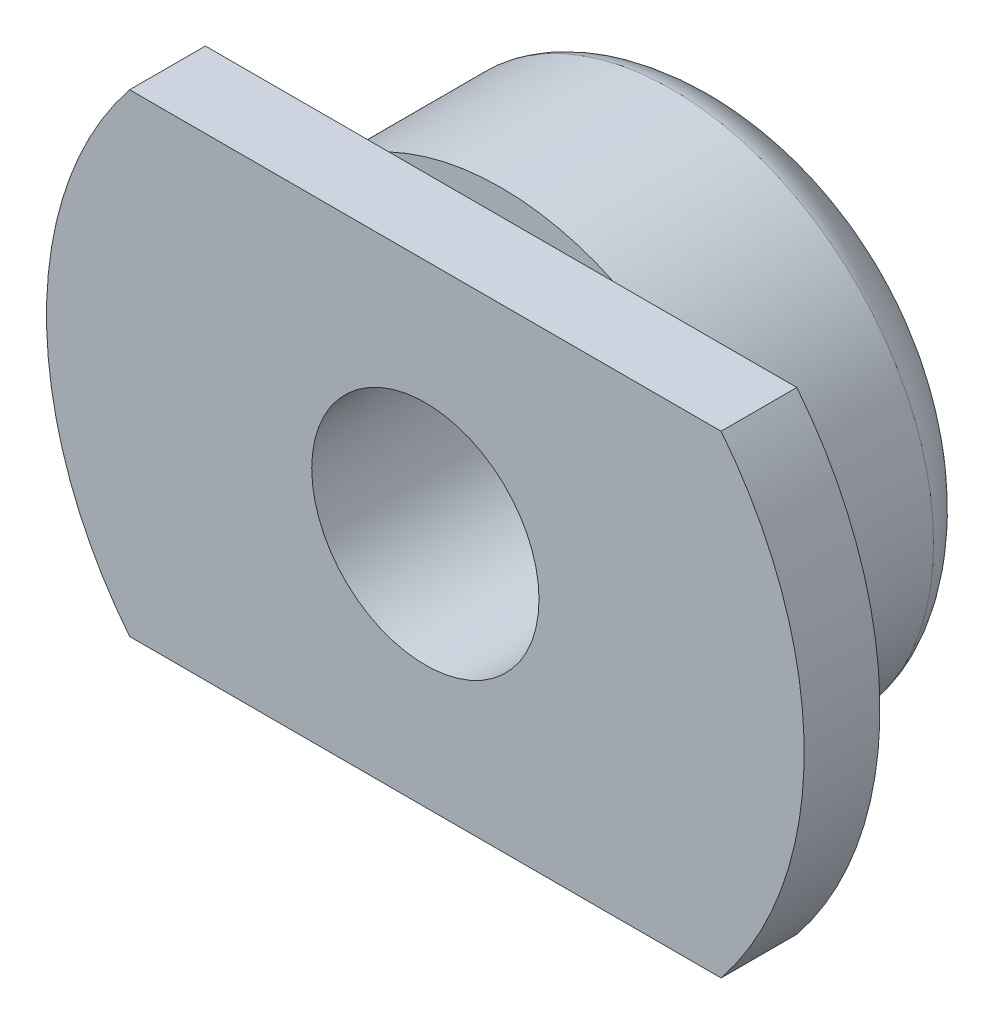
ISO-10303-21;
HEADER;
FILE_DESCRIPTION(('STEP AP214'),'2;1');
FILE_NAME('part.step','',(''),(''),'','','');
FILE_SCHEMA(('AUTOMOTIVE_DESIGN { 1 0 10303 214 1 1 1 1 }'));
ENDSEC;
DATA;
#1=APPLICATION_CONTEXT('core data for automotive mechanical design processes');
#2=APPLICATION_PROTOCOL_DEFINITION('international standard','automotive_design',2000,#1);
#3=PRODUCT_CONTEXT('',#1,'mechanical');
#4=PRODUCT('Part','Part','',(#3));
#5=PRODUCT_RELATED_PRODUCT_CATEGORY('part','',(#4));
#6=PRODUCT_DEFINITION_FORMATION('','',#4);
#7=PRODUCT_DEFINITION_CONTEXT('part definition',#1,'design');
#8=PRODUCT_DEFINITION('design','',#6,#7);
#9=PRODUCT_DEFINITION_SHAPE('','',#8);
#10=(LENGTH_UNIT() NAMED_UNIT(*) SI_UNIT(.MILLI.,.METRE.));
#11=(NAMED_UNIT(*) PLANE_ANGLE_UNIT() SI_UNIT($,.RADIAN.));
#12=(NAMED_UNIT(*) SI_UNIT($,.STERADIAN.) SOLID_ANGLE_UNIT());
#13=UNCERTAINTY_MEASURE_WITH_UNIT(LENGTH_MEASURE(1.E-05),#10,'distance_accuracy_value','');
#14=(GEOMETRIC_REPRESENTATION_CONTEXT(3) GLOBAL_UNCERTAINTY_ASSIGNED_CONTEXT((#13)) GLOBAL_UNIT_ASSIGNED_CONTEXT((#10,
#11,#12)) REPRESENTATION_CONTEXT('',''));
#15=CARTESIAN_POINT('',(0.,0.,0.));
#16=DIRECTION('',(0.,0.,1.));
#17=DIRECTION('',(1.,0.,0.));
#18=AXIS2_PLACEMENT_3D('',#15,#16,#17);
#19=CARTESIAN_POINT('',(0.,0.,5.4));
#20=DIRECTION('',(0.,0.,-1.));
#21=DIRECTION('',(-1.,0.,0.));
#22=AXIS2_PLACEMENT_3D('',#19,#20,#21);
#23=CYLINDRICAL_SURFACE('',#22,6.);
#24=DIRECTION('',(0.,0.,-1.));
#25=VECTOR('',#24,1.);
#26=CARTESIAN_POINT('',(4.6837484987988,3.75,5.4));
#27=LINE('',#26,#25);
#28=CARTESIAN_POINT('',(4.6837484987988,3.75,5.4));
#29=VERTEX_POINT('',#28);
#30=CARTESIAN_POINT('',(4.6837484987988,3.75,4.2));
#31=VERTEX_POINT('',#30);
#32=EDGE_CURVE('E123',#29,#31,#27,.T.);
#33=ORIENTED_EDGE('',*,*,#32,.F.);
#34=CARTESIAN_POINT('',(0.,0.,5.4));
#35=DIRECTION('',(0.,0.,1.));
#36=DIRECTION('',(1.,0.,0.));
#37=AXIS2_PLACEMENT_3D('',#34,#35,#36);
#38=CIRCLE('',#37,6.);
#39=CARTESIAN_POINT('',(4.6837484987988,-3.75,5.4));
#40=VERTEX_POINT('',#39);
#41=EDGE_CURVE('E116',#40,#29,#38,.T.);
#42=ORIENTED_EDGE('',*,*,#41,.F.);
#43=DIRECTION('',(0.,0.,-1.));
#44=VECTOR('',#43,1.);
#45=CARTESIAN_POINT('',(4.6837484987988,-3.75,5.4));
#46=LINE('',#45,#44);
#47=CARTESIAN_POINT('',(4.6837484987988,-3.75,4.2));
#48=VERTEX_POINT('',#47);
#49=EDGE_CURVE('E95',#48,#40,#46,.F.);
#50=ORIENTED_EDGE('',*,*,#49,.F.);
#51=CARTESIAN_POINT('',(0.,0.,4.2));
#52=DIRECTION('',(0.,0.,1.));
#53=DIRECTION('',(1.,0.,0.));
#54=AXIS2_PLACEMENT_3D('',#51,#52,#53);
#55=CIRCLE('',#54,6.);
#56=EDGE_CURVE('E125',#48,#31,#55,.T.);
#57=ORIENTED_EDGE('',*,*,#56,.T.);
#58=EDGE_LOOP('',(#33,#42,#50,#57));
#59=FACE_BOUND('',#58,.T.);
#60=ADVANCED_FACE('F39',(#59),#23,.T.);
#61=DIRECTION('',(0.,0.,-1.));
#62=VECTOR('',#61,1.);
#63=CARTESIAN_POINT('',(-4.6837484987988,3.75,5.4));
#64=LINE('',#63,#62);
#65=CARTESIAN_POINT('',(-4.6837484987988,3.75,4.2));
#66=VERTEX_POINT('',#65);
#67=CARTESIAN_POINT('',(-4.6837484987988,3.75,5.4));
#68=VERTEX_POINT('',#67);
#69=EDGE_CURVE('E111',#66,#68,#64,.F.);
#70=ORIENTED_EDGE('',*,*,#69,.F.);
#71=CARTESIAN_POINT('',(-4.6837484987988,-3.75,4.2));
#72=VERTEX_POINT('',#71);
#73=EDGE_CURVE('E110',#66,#72,#55,.T.);
#74=ORIENTED_EDGE('',*,*,#73,.T.);
#75=DIRECTION('',(0.,0.,-1.));
#76=VECTOR('',#75,1.);
#77=CARTESIAN_POINT('',(-4.6837484987988,-3.75,5.4));
#78=LINE('',#77,#76);
#79=CARTESIAN_POINT('',(-4.6837484987988,-3.75,5.4));
#80=VERTEX_POINT('',#79);
#81=EDGE_CURVE('E92',#80,#72,#78,.T.);
#82=ORIENTED_EDGE('',*,*,#81,.F.);
#83=EDGE_CURVE('E108',#68,#80,#38,.T.);
#84=ORIENTED_EDGE('',*,*,#83,.F.);
#85=EDGE_LOOP('',(#70,#74,#82,#84));
#86=FACE_BOUND('',#85,.T.);
#87=ADVANCED_FACE('F107',(#86),#23,.T.);
#88=CARTESIAN_POINT('',(0.,0.,5.4));
#89=DIRECTION('',(0.,0.,1.));
#90=DIRECTION('',(1.,0.,0.));
#91=AXIS2_PLACEMENT_3D('',#88,#89,#90);
#92=PLANE('',#91);
#93=CARTESIAN_POINT('',(0.000210646153013527,-7.86805516572731E-08,5.4));
#94=DIRECTION('',(0.,0.,1.));
#95=DIRECTION('',(1.,0.,0.));
#96=AXIS2_PLACEMENT_3D('',#93,#94,#95);
#97=CIRCLE('',#96,1.8);
#98=CARTESIAN_POINT('',(1.80021064615301,-7.86805516572731E-08,5.4));
#99=VERTEX_POINT('',#98);
#100=EDGE_CURVE('E162',#99,#99,#97,.T.);
#101=ORIENTED_EDGE('',*,*,#100,.F.);
#102=EDGE_LOOP('',(#101));
#103=FACE_BOUND('',#102,.T.);
#104=ORIENTED_EDGE('',*,*,#41,.T.);
#105=DIRECTION('',(-1.,0.,0.));
#106=VECTOR('',#105,1.);
#107=CARTESIAN_POINT('',(6.5,3.75,5.4));
#108=LINE('',#107,#106);
#109=EDGE_CURVE('E100',#29,#68,#108,.T.);
#110=ORIENTED_EDGE('',*,*,#109,.T.);
#111=ORIENTED_EDGE('',*,*,#83,.T.);
#112=DIRECTION('',(1.,0.,0.));
#113=VECTOR('',#112,1.);
#114=CARTESIAN_POINT('',(6.5,-3.75,5.4));
#115=LINE('',#114,#113);
#116=EDGE_CURVE('E89',#80,#40,#115,.T.);
#117=ORIENTED_EDGE('',*,*,#116,.T.);
#118=EDGE_LOOP('',(#104,#110,#111,#117));
#119=FACE_BOUND('',#118,.T.);
#120=ADVANCED_FACE('F114',(#103,#119),#92,.T.);
#121=CARTESIAN_POINT('',(0.,0.,4.2));
#122=DIRECTION('',(0.,0.,1.));
#123=DIRECTION('',(1.,0.,0.));
#124=AXIS2_PLACEMENT_3D('',#121,#122,#123);
#125=PLANE('',#124);
#126=DIRECTION('',(-1.,0.,0.));
#127=VECTOR('',#126,1.);
#128=CARTESIAN_POINT('',(0.,3.75,4.2));
#129=LINE('',#128,#127);
#130=CARTESIAN_POINT('',(1.77763888346312,3.75,4.2));
#131=VERTEX_POINT('',#130);
#132=EDGE_CURVE('E12',#31,#131,#129,.T.);
#133=ORIENTED_EDGE('',*,*,#132,.F.);
#134=ORIENTED_EDGE('',*,*,#56,.F.);
#135=DIRECTION('',(1.,0.,0.));
#136=VECTOR('',#135,1.);
#137=CARTESIAN_POINT('',(0.,-3.75,4.2));
#138=LINE('',#137,#136);
#139=CARTESIAN_POINT('',(1.77763888346312,-3.75,4.2));
#140=VERTEX_POINT('',#139);
#141=EDGE_CURVE('E279',#140,#48,#138,.T.);
#142=ORIENTED_EDGE('',*,*,#141,.F.);
#143=CARTESIAN_POINT('',(0.,0.,4.2));
#144=DIRECTION('',(0.,0.,1.));
#145=DIRECTION('',(1.,0.,0.));
#146=AXIS2_PLACEMENT_3D('',#143,#144,#145);
#147=CIRCLE('',#146,4.15);
#148=EDGE_CURVE('E280',#140,#131,#147,.T.);
#149=ORIENTED_EDGE('',*,*,#148,.T.);
#150=EDGE_LOOP('',(#133,#134,#142,#149));
#151=FACE_BOUND('',#150,.T.);
#152=ADVANCED_FACE('F178',(#151),#125,.F.);
#153=CARTESIAN_POINT('',(-1.77763888346312,3.75,4.2));
#154=VERTEX_POINT('',#153);
#155=EDGE_CURVE('E43',#154,#66,#129,.T.);
#156=ORIENTED_EDGE('',*,*,#155,.F.);
#157=CARTESIAN_POINT('',(-1.77763888346311,-3.75,4.2));
#158=VERTEX_POINT('',#157);
#159=EDGE_CURVE('E270',#154,#158,#147,.T.);
#160=ORIENTED_EDGE('',*,*,#159,.T.);
#161=EDGE_CURVE('E271',#72,#158,#138,.T.);
#162=ORIENTED_EDGE('',*,*,#161,.F.);
#163=ORIENTED_EDGE('',*,*,#73,.F.);
#164=EDGE_LOOP('',(#156,#160,#162,#163));
#165=FACE_BOUND('',#164,.T.);
#166=ADVANCED_FACE('F183',(#165),#125,.F.);
#167=CARTESIAN_POINT('',(0.,0.,17.2));
#168=DIRECTION('',(0.,0.,-1.));
#169=DIRECTION('',(-1.,0.,0.));
#170=AXIS2_PLACEMENT_3D('',#167,#168,#169);
#171=CYLINDRICAL_SURFACE('',#170,4.15);
#172=CARTESIAN_POINT('',(0.,0.,1.50000000000001));
#173=DIRECTION('',(0.,0.,-1.));
#174=DIRECTION('',(-1.,0.,0.));
#175=AXIS2_PLACEMENT_3D('',#172,#173,#174);
#176=CIRCLE('',#175,4.15);
#177=CARTESIAN_POINT('',(-4.15,0.,1.50000000000001));
#178=VERTEX_POINT('',#177);
#179=EDGE_CURVE('E119',#178,#178,#176,.T.);
#180=ORIENTED_EDGE('',*,*,#179,.F.);
#181=EDGE_LOOP('',(#180));
#182=FACE_BOUND('',#181,.T.);
#183=EDGE_CURVE('E276',#131,#154,#147,.T.);
#184=ORIENTED_EDGE('',*,*,#183,.F.);
#185=ORIENTED_EDGE('',*,*,#148,.F.);
#186=EDGE_CURVE('E277',#158,#140,#147,.T.);
#187=ORIENTED_EDGE('',*,*,#186,.F.);
#188=ORIENTED_EDGE('',*,*,#159,.F.);
#189=EDGE_LOOP('',(#184,#185,#187,#188));
#190=FACE_BOUND('',#189,.T.);
#191=ADVANCED_FACE('F41',(#182,#190),#171,.T.);
#192=CARTESIAN_POINT('',(0.,4.15,1.50000000000001));
#193=CARTESIAN_POINT('',(0.,4.05537317860218,0.922815805737262));
#194=CARTESIAN_POINT('',(0.,2.84655662610956,-0.00317399949750981));
#195=CARTESIAN_POINT('',(0.,1.43187539710622,0.));
#196=B_SPLINE_CURVE_WITH_KNOTS('',3,(#192,#193,#194,#195),.UNSPECIFIED.,.F.,.F.,(4,4),(0.,
0.91074495904114),.UNSPECIFIED.);
#197=CARTESIAN_POINT('',(0.,0.,0.));
#198=DIRECTION('',(0.,0.,-1.));
#199=AXIS1_PLACEMENT('',#197,#198);
#200=SURFACE_OF_REVOLUTION('',#196,#199);
#201=CARTESIAN_POINT('',(0.,0.,0.));
#202=DIRECTION('',(0.,0.,-1.));
#203=DIRECTION('',(-1.,0.,0.));
#204=AXIS2_PLACEMENT_3D('',#201,#202,#203);
#205=CIRCLE('',#204,1.43187539710622);
#206=CARTESIAN_POINT('',(-1.43187539710622,0.,0.));
#207=VERTEX_POINT('',#206);
#208=EDGE_CURVE('E115',#207,#207,#205,.T.);
#209=ORIENTED_EDGE('',*,*,#208,.F.);
#210=EDGE_LOOP('',(#209));
#211=FACE_BOUND('',#210,.T.);
#212=ORIENTED_EDGE('',*,*,#179,.T.);
#213=EDGE_LOOP('',(#212));
#214=FACE_BOUND('',#213,.T.);
#215=ADVANCED_FACE('F136',(#211,#214),#200,.T.);
#216=CARTESIAN_POINT('',(0.,0.,0.));
#217=DIRECTION('',(0.,0.,1.));
#218=DIRECTION('',(1.,0.,0.));
#219=AXIS2_PLACEMENT_3D('',#216,#217,#218);
#220=PLANE('',#219);
#221=ORIENTED_EDGE('',*,*,#208,.T.);
#222=EDGE_LOOP('',(#221));
#223=FACE_BOUND('',#222,.T.);
#224=ADVANCED_FACE('F139',(#223),#220,.F.);
#225=CARTESIAN_POINT('',(6.5,-3.75,4.2));
#226=DIRECTION('',(0.,-1.,0.));
#227=DIRECTION('',(1.,0.,0.));
#228=AXIS2_PLACEMENT_3D('',#225,#226,#227);
#229=PLANE('',#228);
#230=ORIENTED_EDGE('',*,*,#81,.T.);
#231=ORIENTED_EDGE('',*,*,#161,.T.);
#232=DIRECTION('',(1.,0.,0.));
#233=VECTOR('',#232,1.);
#234=CARTESIAN_POINT('',(6.5,-3.75,4.2));
#235=LINE('',#234,#233);
#236=EDGE_CURVE('E54',#158,#140,#235,.T.);
#237=ORIENTED_EDGE('',*,*,#236,.T.);
#238=ORIENTED_EDGE('',*,*,#141,.T.);
#239=ORIENTED_EDGE('',*,*,#49,.T.);
#240=ORIENTED_EDGE('',*,*,#116,.F.);
#241=EDGE_LOOP('',(#230,#231,#237,#238,#239,#240));
#242=FACE_BOUND('',#241,.T.);
#243=ADVANCED_FACE('F91',(#242),#229,.T.);
#244=CARTESIAN_POINT('',(0.,0.,4.2));
#245=DIRECTION('',(0.,0.,1.));
#246=DIRECTION('',(1.,0.,0.));
#247=AXIS2_PLACEMENT_3D('',#244,#245,#246);
#248=PLANE('',#247);
#249=ORIENTED_EDGE('',*,*,#186,.T.);
#250=ORIENTED_EDGE('',*,*,#236,.F.);
#251=EDGE_LOOP('',(#249,#250));
#252=FACE_BOUND('',#251,.T.);
#253=ADVANCED_FACE('F147',(#252),#248,.T.);
#254=ORIENTED_EDGE('',*,*,#183,.T.);
#255=DIRECTION('',(-1.,0.,0.));
#256=VECTOR('',#255,1.);
#257=CARTESIAN_POINT('',(6.5,3.75,4.2));
#258=LINE('',#257,#256);
#259=EDGE_CURVE('E61',#131,#154,#258,.T.);
#260=ORIENTED_EDGE('',*,*,#259,.F.);
#261=EDGE_LOOP('',(#254,#260));
#262=FACE_BOUND('',#261,.T.);
#263=ADVANCED_FACE('F186',(#262),#248,.T.);
#264=CARTESIAN_POINT('',(6.5,3.75,4.2));
#265=DIRECTION('',(0.,1.,0.));
#266=DIRECTION('',(-1.,0.,0.));
#267=AXIS2_PLACEMENT_3D('',#264,#265,#266);
#268=PLANE('',#267);
#269=ORIENTED_EDGE('',*,*,#32,.T.);
#270=ORIENTED_EDGE('',*,*,#132,.T.);
#271=ORIENTED_EDGE('',*,*,#259,.T.);
#272=ORIENTED_EDGE('',*,*,#155,.T.);
#273=ORIENTED_EDGE('',*,*,#69,.T.);
#274=ORIENTED_EDGE('',*,*,#109,.F.);
#275=EDGE_LOOP('',(#269,#270,#271,#272,#273,#274));
#276=FACE_BOUND('',#275,.T.);
#277=ADVANCED_FACE('F173',(#276),#268,.T.);
#278=CARTESIAN_POINT('',(0.000210646153013527,-7.86805516572731E-08,1.4));
#279=DIRECTION('',(0.,0.,1.));
#280=DIRECTION('',(1.,0.,0.));
#281=AXIS2_PLACEMENT_3D('',#278,#279,#280);
#282=CYLINDRICAL_SURFACE('',#281,1.8);
#283=CARTESIAN_POINT('',(0.000210646153013527,-7.86805516572731E-08,1.4));
#284=DIRECTION('',(0.,0.,1.));
#285=DIRECTION('',(1.,0.,0.));
#286=AXIS2_PLACEMENT_3D('',#283,#284,#285);
#287=CIRCLE('',#286,1.8);
#288=CARTESIAN_POINT('',(1.80021064615301,-7.86805516572731E-08,1.4));
#289=VERTEX_POINT('',#288);
#290=EDGE_CURVE('E101',#289,#289,#287,.T.);
#291=ORIENTED_EDGE('',*,*,#290,.F.);
#292=EDGE_LOOP('',(#291));
#293=FACE_BOUND('',#292,.T.);
#294=ORIENTED_EDGE('',*,*,#100,.T.);
#295=EDGE_LOOP('',(#294));
#296=FACE_BOUND('',#295,.T.);
#297=ADVANCED_FACE('F170',(#293,#296),#282,.F.);
#298=CARTESIAN_POINT('',(0.000210646153013527,-7.86805516572731E-08,1.4));
#299=DIRECTION('',(0.,0.,1.));
#300=DIRECTION('',(1.,0.,0.));
#301=AXIS2_PLACEMENT_3D('',#298,#299,#300);
#302=PLANE('',#301);
#303=ORIENTED_EDGE('',*,*,#290,.T.);
#304=EDGE_LOOP('',(#303));
#305=FACE_BOUND('',#304,.T.);
#306=ADVANCED_FACE('F168',(#305),#302,.T.);
#307=CLOSED_SHELL('',(#60,#87,#120,#152,#166,#191,#215,#224,#243,#253,#263,#277,#297,#306));
#308=MANIFOLD_SOLID_BREP('B2',#307);
#309=ADVANCED_BREP_SHAPE_REPRESENTATION('',(#18,#308),#14);
#310=SHAPE_DEFINITION_REPRESENTATION(#9,#309);
ENDSEC;
END-ISO-10303-21;
